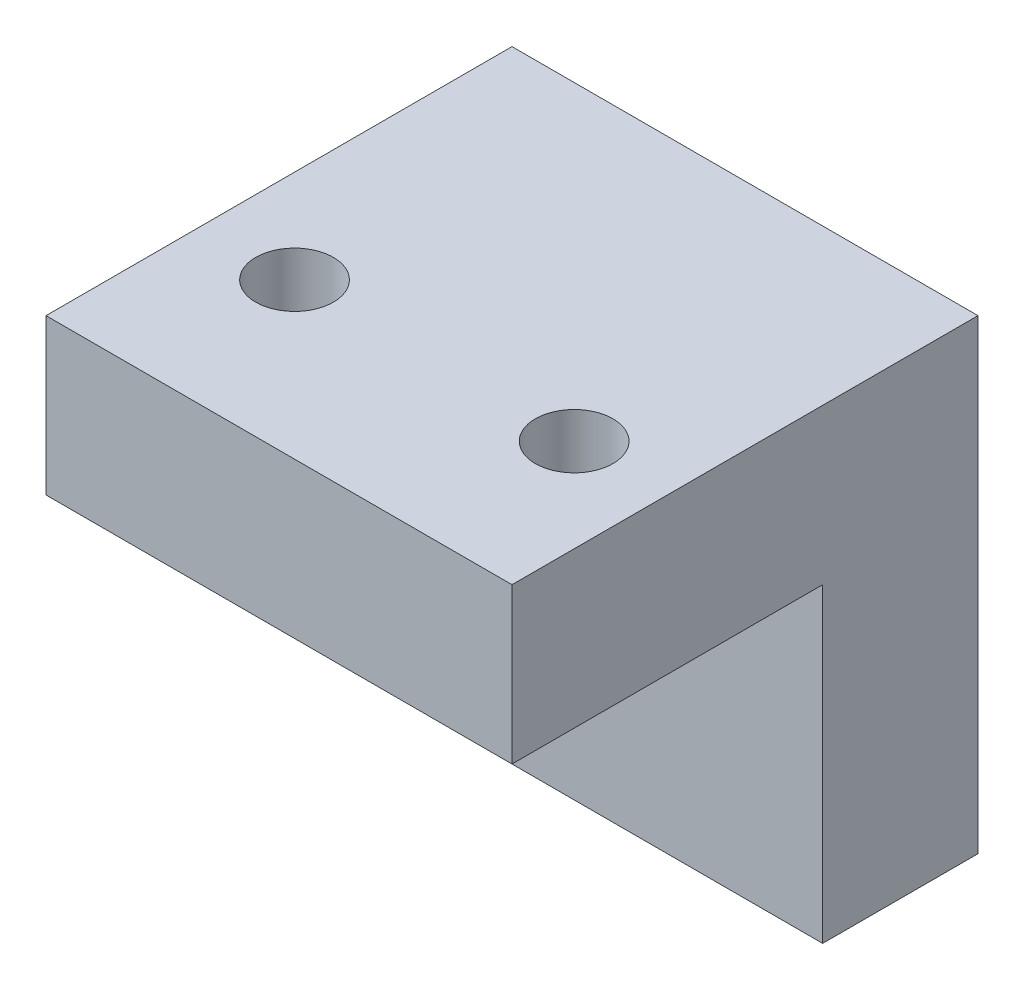
ISO-10303-21;
HEADER;
FILE_DESCRIPTION(('STEP AP214'),'2;1');
FILE_NAME('part.step','',(''),(''),'','','');
FILE_SCHEMA(('AUTOMOTIVE_DESIGN { 1 0 10303 214 1 1 1 1 }'));
ENDSEC;
DATA;
#1=APPLICATION_CONTEXT('core data for automotive mechanical design processes');
#2=APPLICATION_PROTOCOL_DEFINITION('international standard','automotive_design',2000,#1);
#3=PRODUCT_CONTEXT('',#1,'mechanical');
#4=PRODUCT('Part','Part','',(#3));
#5=PRODUCT_RELATED_PRODUCT_CATEGORY('part','',(#4));
#6=PRODUCT_DEFINITION_FORMATION('','',#4);
#7=PRODUCT_DEFINITION_CONTEXT('part definition',#1,'design');
#8=PRODUCT_DEFINITION('design','',#6,#7);
#9=PRODUCT_DEFINITION_SHAPE('','',#8);
#10=(LENGTH_UNIT() NAMED_UNIT(*) SI_UNIT(.MILLI.,.METRE.));
#11=(NAMED_UNIT(*) PLANE_ANGLE_UNIT() SI_UNIT($,.RADIAN.));
#12=(NAMED_UNIT(*) SI_UNIT($,.STERADIAN.) SOLID_ANGLE_UNIT());
#13=UNCERTAINTY_MEASURE_WITH_UNIT(LENGTH_MEASURE(1.E-05),#10,'distance_accuracy_value','');
#14=(GEOMETRIC_REPRESENTATION_CONTEXT(3) GLOBAL_UNCERTAINTY_ASSIGNED_CONTEXT((#13)) GLOBAL_UNIT_ASSIGNED_CONTEXT((#10,
#11,#12)) REPRESENTATION_CONTEXT('',''));
#15=CARTESIAN_POINT('',(0.,0.,0.));
#16=DIRECTION('',(0.,0.,1.));
#17=DIRECTION('',(1.,0.,0.));
#18=AXIS2_PLACEMENT_3D('',#15,#16,#17);
#19=CARTESIAN_POINT('',(0.,10.,0.));
#20=DIRECTION('',(1.,0.,0.));
#21=DIRECTION('',(0.,0.,-1.));
#22=AXIS2_PLACEMENT_3D('',#19,#20,#21);
#23=PLANE('',#22);
#24=DIRECTION('',(0.,0.,1.));
#25=VECTOR('',#24,1.);
#26=CARTESIAN_POINT('',(0.,0.,0.));
#27=LINE('',#26,#25);
#28=CARTESIAN_POINT('',(0.,0.,-5.));
#29=VERTEX_POINT('',#28);
#30=CARTESIAN_POINT('',(0.,0.,0.));
#31=VERTEX_POINT('',#30);
#32=EDGE_CURVE('E101',#29,#31,#27,.T.);
#33=ORIENTED_EDGE('',*,*,#32,.T.);
#34=DIRECTION('',(0.,-1.,0.));
#35=VECTOR('',#34,1.);
#36=CARTESIAN_POINT('',(0.,10.,0.));
#37=LINE('',#36,#35);
#38=CARTESIAN_POINT('',(0.,10.,0.));
#39=VERTEX_POINT('',#38);
#40=EDGE_CURVE('E12',#39,#31,#37,.T.);
#41=ORIENTED_EDGE('',*,*,#40,.F.);
#42=DIRECTION('',(0.,0.,1.));
#43=VECTOR('',#42,1.);
#44=CARTESIAN_POINT('',(0.,10.,-5.));
#45=LINE('',#44,#43);
#46=CARTESIAN_POINT('',(0.,10.,10.));
#47=VERTEX_POINT('',#46);
#48=EDGE_CURVE('E126',#39,#47,#45,.T.);
#49=ORIENTED_EDGE('',*,*,#48,.T.);
#50=DIRECTION('',(0.,-1.,0.));
#51=VECTOR('',#50,1.);
#52=CARTESIAN_POINT('',(0.,15.,10.));
#53=LINE('',#52,#51);
#54=CARTESIAN_POINT('',(0.,15.,10.));
#55=VERTEX_POINT('',#54);
#56=EDGE_CURVE('E120',#55,#47,#53,.T.);
#57=ORIENTED_EDGE('',*,*,#56,.F.);
#58=DIRECTION('',(0.,0.,1.));
#59=VECTOR('',#58,1.);
#60=CARTESIAN_POINT('',(0.,15.,-5.));
#61=LINE('',#60,#59);
#62=CARTESIAN_POINT('',(0.,15.,-5.));
#63=VERTEX_POINT('',#62);
#64=EDGE_CURVE('E110',#63,#55,#61,.T.);
#65=ORIENTED_EDGE('',*,*,#64,.F.);
#66=DIRECTION('',(0.,-1.,0.));
#67=VECTOR('',#66,1.);
#68=CARTESIAN_POINT('',(0.,10.,-5.));
#69=LINE('',#68,#67);
#70=EDGE_CURVE('E96',#63,#29,#69,.T.);
#71=ORIENTED_EDGE('',*,*,#70,.T.);
#72=EDGE_LOOP('',(#33,#41,#49,#57,#65,#71));
#73=FACE_BOUND('',#72,.T.);
#74=ADVANCED_FACE('F44',(#73),#23,.F.);
#75=CARTESIAN_POINT('',(0.,10.,0.));
#76=DIRECTION('',(0.,0.,-1.));
#77=DIRECTION('',(-1.,0.,0.));
#78=AXIS2_PLACEMENT_3D('',#75,#76,#77);
#79=PLANE('',#78);
#80=CARTESIAN_POINT('',(7.5,5.,0.));
#81=DIRECTION('',(0.,0.,1.));
#82=DIRECTION('',(1.,0.,0.));
#83=AXIS2_PLACEMENT_3D('',#80,#81,#82);
#84=CIRCLE('',#83,1.25);
#85=CARTESIAN_POINT('',(8.75,5.,0.));
#86=VERTEX_POINT('',#85);
#87=EDGE_CURVE('E158',#86,#86,#84,.T.);
#88=ORIENTED_EDGE('',*,*,#87,.F.);
#89=EDGE_LOOP('',(#88));
#90=FACE_BOUND('',#89,.T.);
#91=DIRECTION('',(1.,0.,0.));
#92=VECTOR('',#91,1.);
#93=CARTESIAN_POINT('',(0.,0.,0.));
#94=LINE('',#93,#92);
#95=CARTESIAN_POINT('',(15.,0.,0.));
#96=VERTEX_POINT('',#95);
#97=EDGE_CURVE('E87',#31,#96,#94,.T.);
#98=ORIENTED_EDGE('',*,*,#97,.T.);
#99=DIRECTION('',(0.,-1.,0.));
#100=VECTOR('',#99,1.);
#101=CARTESIAN_POINT('',(15.,10.,0.));
#102=LINE('',#101,#100);
#103=CARTESIAN_POINT('',(15.,10.,0.));
#104=VERTEX_POINT('',#103);
#105=EDGE_CURVE('E52',#104,#96,#102,.T.);
#106=ORIENTED_EDGE('',*,*,#105,.F.);
#107=DIRECTION('',(1.,0.,0.));
#108=VECTOR('',#107,1.);
#109=CARTESIAN_POINT('',(0.,10.,0.));
#110=LINE('',#109,#108);
#111=EDGE_CURVE('E58',#39,#104,#110,.T.);
#112=ORIENTED_EDGE('',*,*,#111,.F.);
#113=ORIENTED_EDGE('',*,*,#40,.T.);
#114=EDGE_LOOP('',(#98,#106,#112,#113));
#115=FACE_BOUND('',#114,.T.);
#116=ADVANCED_FACE('F139',(#90,#115),#79,.F.);
#117=CARTESIAN_POINT('',(15.,10.,0.));
#118=DIRECTION('',(-1.,0.,0.));
#119=DIRECTION('',(0.,0.,1.));
#120=AXIS2_PLACEMENT_3D('',#117,#118,#119);
#121=PLANE('',#120);
#122=DIRECTION('',(0.,0.,-1.));
#123=VECTOR('',#122,1.);
#124=CARTESIAN_POINT('',(15.,0.,0.));
#125=LINE('',#124,#123);
#126=CARTESIAN_POINT('',(15.,0.,-5.));
#127=VERTEX_POINT('',#126);
#128=EDGE_CURVE('E76',#96,#127,#125,.T.);
#129=ORIENTED_EDGE('',*,*,#128,.T.);
#130=DIRECTION('',(0.,-1.,0.));
#131=VECTOR('',#130,1.);
#132=CARTESIAN_POINT('',(15.,10.,-5.));
#133=LINE('',#132,#131);
#134=CARTESIAN_POINT('',(15.,15.,-5.));
#135=VERTEX_POINT('',#134);
#136=EDGE_CURVE('E81',#135,#127,#133,.T.);
#137=ORIENTED_EDGE('',*,*,#136,.F.);
#138=DIRECTION('',(0.,0.,-1.));
#139=VECTOR('',#138,1.);
#140=CARTESIAN_POINT('',(15.,15.,-5.));
#141=LINE('',#140,#139);
#142=CARTESIAN_POINT('',(15.,15.,10.));
#143=VERTEX_POINT('',#142);
#144=EDGE_CURVE('E116',#143,#135,#141,.T.);
#145=ORIENTED_EDGE('',*,*,#144,.F.);
#146=DIRECTION('',(0.,-1.,0.));
#147=VECTOR('',#146,1.);
#148=CARTESIAN_POINT('',(15.,15.,10.));
#149=LINE('',#148,#147);
#150=CARTESIAN_POINT('',(15.,10.,10.));
#151=VERTEX_POINT('',#150);
#152=EDGE_CURVE('E117',#143,#151,#149,.T.);
#153=ORIENTED_EDGE('',*,*,#152,.T.);
#154=DIRECTION('',(0.,0.,-1.));
#155=VECTOR('',#154,1.);
#156=CARTESIAN_POINT('',(15.,10.,-5.));
#157=LINE('',#156,#155);
#158=EDGE_CURVE('E133',#151,#104,#157,.T.);
#159=ORIENTED_EDGE('',*,*,#158,.T.);
#160=ORIENTED_EDGE('',*,*,#105,.T.);
#161=EDGE_LOOP('',(#129,#137,#145,#153,#159,#160));
#162=FACE_BOUND('',#161,.T.);
#163=ADVANCED_FACE('F78',(#162),#121,.F.);
#164=CARTESIAN_POINT('',(0.,10.,-5.));
#165=DIRECTION('',(0.,0.,1.));
#166=DIRECTION('',(1.,0.,0.));
#167=AXIS2_PLACEMENT_3D('',#164,#165,#166);
#168=PLANE('',#167);
#169=CARTESIAN_POINT('',(7.5,5.,-5.));
#170=DIRECTION('',(0.,0.,1.));
#171=DIRECTION('',(1.,0.,0.));
#172=AXIS2_PLACEMENT_3D('',#169,#170,#171);
#173=CIRCLE('',#172,1.25);
#174=CARTESIAN_POINT('',(8.75,5.,-5.));
#175=VERTEX_POINT('',#174);
#176=EDGE_CURVE('E130',#175,#175,#173,.T.);
#177=ORIENTED_EDGE('',*,*,#176,.T.);
#178=EDGE_LOOP('',(#177));
#179=FACE_BOUND('',#178,.T.);
#180=DIRECTION('',(-1.,0.,0.));
#181=VECTOR('',#180,1.);
#182=CARTESIAN_POINT('',(0.,0.,-5.));
#183=LINE('',#182,#181);
#184=EDGE_CURVE('E86',#127,#29,#183,.T.);
#185=ORIENTED_EDGE('',*,*,#184,.T.);
#186=ORIENTED_EDGE('',*,*,#70,.F.);
#187=DIRECTION('',(-1.,0.,0.));
#188=VECTOR('',#187,1.);
#189=CARTESIAN_POINT('',(0.,15.,-5.));
#190=LINE('',#189,#188);
#191=EDGE_CURVE('E95',#135,#63,#190,.T.);
#192=ORIENTED_EDGE('',*,*,#191,.F.);
#193=ORIENTED_EDGE('',*,*,#136,.T.);
#194=EDGE_LOOP('',(#185,#186,#192,#193));
#195=FACE_BOUND('',#194,.T.);
#196=ADVANCED_FACE('F91',(#179,#195),#168,.F.);
#197=CARTESIAN_POINT('',(0.,0.,0.));
#198=DIRECTION('',(0.,-1.,0.));
#199=DIRECTION('',(0.,0.,-1.));
#200=AXIS2_PLACEMENT_3D('',#197,#198,#199);
#201=PLANE('',#200);
#202=ORIENTED_EDGE('',*,*,#32,.F.);
#203=ORIENTED_EDGE('',*,*,#184,.F.);
#204=ORIENTED_EDGE('',*,*,#128,.F.);
#205=ORIENTED_EDGE('',*,*,#97,.F.);
#206=EDGE_LOOP('',(#202,#203,#204,#205));
#207=FACE_BOUND('',#206,.T.);
#208=ADVANCED_FACE('F99',(#207),#201,.T.);
#209=CARTESIAN_POINT('',(0.,10.,0.));
#210=DIRECTION('',(0.,1.,0.));
#211=DIRECTION('',(0.,0.,1.));
#212=AXIS2_PLACEMENT_3D('',#209,#210,#211);
#213=PLANE('',#212);
#214=CARTESIAN_POINT('',(3.,10.,5.));
#215=DIRECTION('',(0.,1.,0.));
#216=DIRECTION('',(0.,0.,1.));
#217=AXIS2_PLACEMENT_3D('',#214,#215,#216);
#218=CIRCLE('',#217,1.25);
#219=CARTESIAN_POINT('',(3.,10.,6.25));
#220=VERTEX_POINT('',#219);
#221=EDGE_CURVE('E161',#220,#220,#218,.T.);
#222=ORIENTED_EDGE('',*,*,#221,.T.);
#223=EDGE_LOOP('',(#222));
#224=FACE_BOUND('',#223,.T.);
#225=CARTESIAN_POINT('',(12.,10.,5.));
#226=DIRECTION('',(0.,1.,0.));
#227=DIRECTION('',(0.,0.,1.));
#228=AXIS2_PLACEMENT_3D('',#225,#226,#227);
#229=CIRCLE('',#228,1.25);
#230=CARTESIAN_POINT('',(12.,10.,6.25));
#231=VERTEX_POINT('',#230);
#232=EDGE_CURVE('E167',#231,#231,#229,.T.);
#233=ORIENTED_EDGE('',*,*,#232,.T.);
#234=EDGE_LOOP('',(#233));
#235=FACE_BOUND('',#234,.T.);
#236=ORIENTED_EDGE('',*,*,#48,.F.);
#237=ORIENTED_EDGE('',*,*,#111,.T.);
#238=ORIENTED_EDGE('',*,*,#158,.F.);
#239=DIRECTION('',(1.,0.,0.));
#240=VECTOR('',#239,1.);
#241=CARTESIAN_POINT('',(0.,10.,10.));
#242=LINE('',#241,#240);
#243=EDGE_CURVE('E129',#47,#151,#242,.T.);
#244=ORIENTED_EDGE('',*,*,#243,.F.);
#245=EDGE_LOOP('',(#236,#237,#238,#244));
#246=FACE_BOUND('',#245,.T.);
#247=ADVANCED_FACE('F144',(#224,#235,#246),#213,.F.);
#248=CARTESIAN_POINT('',(0.,15.,10.));
#249=DIRECTION('',(0.,0.,-1.));
#250=DIRECTION('',(-1.,0.,0.));
#251=AXIS2_PLACEMENT_3D('',#248,#249,#250);
#252=PLANE('',#251);
#253=ORIENTED_EDGE('',*,*,#243,.T.);
#254=ORIENTED_EDGE('',*,*,#152,.F.);
#255=DIRECTION('',(1.,0.,0.));
#256=VECTOR('',#255,1.);
#257=CARTESIAN_POINT('',(0.,15.,10.));
#258=LINE('',#257,#256);
#259=EDGE_CURVE('E122',#55,#143,#258,.T.);
#260=ORIENTED_EDGE('',*,*,#259,.F.);
#261=ORIENTED_EDGE('',*,*,#56,.T.);
#262=EDGE_LOOP('',(#253,#254,#260,#261));
#263=FACE_BOUND('',#262,.T.);
#264=ADVANCED_FACE('F151',(#263),#252,.F.);
#265=CARTESIAN_POINT('',(0.,15.,0.));
#266=DIRECTION('',(0.,1.,0.));
#267=DIRECTION('',(0.,0.,1.));
#268=AXIS2_PLACEMENT_3D('',#265,#266,#267);
#269=PLANE('',#268);
#270=CARTESIAN_POINT('',(3.,15.,5.));
#271=DIRECTION('',(0.,1.,0.));
#272=DIRECTION('',(0.,0.,1.));
#273=AXIS2_PLACEMENT_3D('',#270,#271,#272);
#274=CIRCLE('',#273,1.25);
#275=CARTESIAN_POINT('',(3.,15.,6.25));
#276=VERTEX_POINT('',#275);
#277=EDGE_CURVE('E170',#276,#276,#274,.T.);
#278=ORIENTED_EDGE('',*,*,#277,.F.);
#279=EDGE_LOOP('',(#278));
#280=FACE_BOUND('',#279,.T.);
#281=CARTESIAN_POINT('',(12.,15.,5.));
#282=DIRECTION('',(0.,1.,0.));
#283=DIRECTION('',(0.,0.,1.));
#284=AXIS2_PLACEMENT_3D('',#281,#282,#283);
#285=CIRCLE('',#284,1.25);
#286=CARTESIAN_POINT('',(12.,15.,6.25));
#287=VERTEX_POINT('',#286);
#288=EDGE_CURVE('E164',#287,#287,#285,.T.);
#289=ORIENTED_EDGE('',*,*,#288,.F.);
#290=EDGE_LOOP('',(#289));
#291=FACE_BOUND('',#290,.T.);
#292=ORIENTED_EDGE('',*,*,#64,.T.);
#293=ORIENTED_EDGE('',*,*,#259,.T.);
#294=ORIENTED_EDGE('',*,*,#144,.T.);
#295=ORIENTED_EDGE('',*,*,#191,.T.);
#296=EDGE_LOOP('',(#292,#293,#294,#295));
#297=FACE_BOUND('',#296,.T.);
#298=ADVANCED_FACE('F113',(#280,#291,#297),#269,.T.);
#299=CARTESIAN_POINT('',(7.5,5.,-5.));
#300=DIRECTION('',(0.,0.,1.));
#301=DIRECTION('',(1.,0.,0.));
#302=AXIS2_PLACEMENT_3D('',#299,#300,#301);
#303=CYLINDRICAL_SURFACE('',#302,1.25);
#304=ORIENTED_EDGE('',*,*,#176,.F.);
#305=EDGE_LOOP('',(#304));
#306=FACE_BOUND('',#305,.T.);
#307=ORIENTED_EDGE('',*,*,#87,.T.);
#308=EDGE_LOOP('',(#307));
#309=FACE_BOUND('',#308,.T.);
#310=ADVANCED_FACE('F187',(#306,#309),#303,.F.);
#311=CARTESIAN_POINT('',(12.,10.,5.));
#312=DIRECTION('',(0.,1.,0.));
#313=DIRECTION('',(0.,0.,1.));
#314=AXIS2_PLACEMENT_3D('',#311,#312,#313);
#315=CYLINDRICAL_SURFACE('',#314,1.25);
#316=ORIENTED_EDGE('',*,*,#232,.F.);
#317=EDGE_LOOP('',(#316));
#318=FACE_BOUND('',#317,.T.);
#319=ORIENTED_EDGE('',*,*,#288,.T.);
#320=EDGE_LOOP('',(#319));
#321=FACE_BOUND('',#320,.T.);
#322=ADVANCED_FACE('F181',(#318,#321),#315,.F.);
#323=CARTESIAN_POINT('',(3.,10.,5.));
#324=DIRECTION('',(0.,1.,0.));
#325=DIRECTION('',(0.,0.,1.));
#326=AXIS2_PLACEMENT_3D('',#323,#324,#325);
#327=CYLINDRICAL_SURFACE('',#326,1.25);
#328=ORIENTED_EDGE('',*,*,#221,.F.);
#329=EDGE_LOOP('',(#328));
#330=FACE_BOUND('',#329,.T.);
#331=ORIENTED_EDGE('',*,*,#277,.T.);
#332=EDGE_LOOP('',(#331));
#333=FACE_BOUND('',#332,.T.);
#334=ADVANCED_FACE('F178',(#330,#333),#327,.F.);
#335=CLOSED_SHELL('',(#74,#116,#163,#196,#208,#247,#264,#298,#310,#322,#334));
#336=MANIFOLD_SOLID_BREP('B2',#335);
#337=ADVANCED_BREP_SHAPE_REPRESENTATION('',(#18,#336),#14);
#338=SHAPE_DEFINITION_REPRESENTATION(#9,#337);
ENDSEC;
END-ISO-10303-21;
